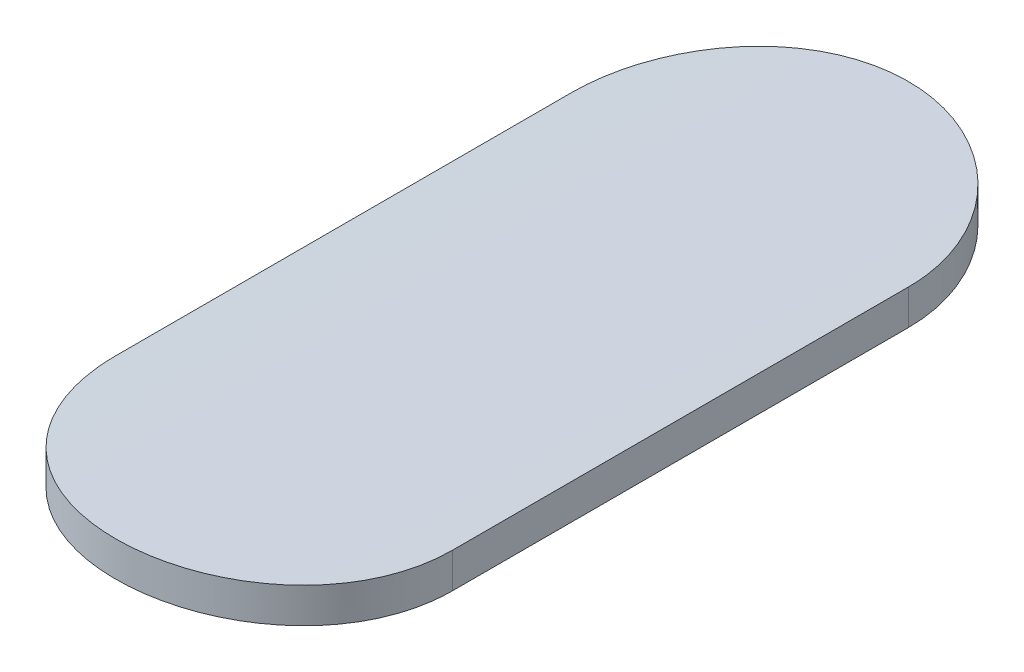
ISO-10303-21;
HEADER;
FILE_DESCRIPTION(('STEP AP214'),'2;1');
FILE_NAME('part.step','',(''),(''),'','','');
FILE_SCHEMA(('AUTOMOTIVE_DESIGN { 1 0 10303 214 1 1 1 1 }'));
ENDSEC;
DATA;
#1=APPLICATION_CONTEXT('core data for automotive mechanical design processes');
#2=APPLICATION_PROTOCOL_DEFINITION('international standard','automotive_design',2000,#1);
#3=PRODUCT_CONTEXT('',#1,'mechanical');
#4=PRODUCT('Part','Part','',(#3));
#5=PRODUCT_RELATED_PRODUCT_CATEGORY('part','',(#4));
#6=PRODUCT_DEFINITION_FORMATION('','',#4);
#7=PRODUCT_DEFINITION_CONTEXT('part definition',#1,'design');
#8=PRODUCT_DEFINITION('design','',#6,#7);
#9=PRODUCT_DEFINITION_SHAPE('','',#8);
#10=(LENGTH_UNIT() NAMED_UNIT(*) SI_UNIT(.MILLI.,.METRE.));
#11=(NAMED_UNIT(*) PLANE_ANGLE_UNIT() SI_UNIT($,.RADIAN.));
#12=(NAMED_UNIT(*) SI_UNIT($,.STERADIAN.) SOLID_ANGLE_UNIT());
#13=UNCERTAINTY_MEASURE_WITH_UNIT(LENGTH_MEASURE(1.E-05),#10,'distance_accuracy_value','');
#14=(GEOMETRIC_REPRESENTATION_CONTEXT(3) GLOBAL_UNCERTAINTY_ASSIGNED_CONTEXT((#13)) GLOBAL_UNIT_ASSIGNED_CONTEXT((#10,
#11,#12)) REPRESENTATION_CONTEXT('',''));
#15=CARTESIAN_POINT('',(0.,0.,0.));
#16=DIRECTION('',(0.,0.,1.));
#17=DIRECTION('',(1.,0.,0.));
#18=AXIS2_PLACEMENT_3D('',#15,#16,#17);
#19=CARTESIAN_POINT('',(-205.237767720161,-97.4477839792411,1.93657000024666));
#20=DIRECTION('',(0.,0.,1.));
#21=DIRECTION('',(1.,0.,0.));
#22=AXIS2_PLACEMENT_3D('',#19,#20,#21);
#23=CYLINDRICAL_SURFACE('',#22,5.00000000000003);
#24=DIRECTION('',(0.,0.,1.));
#25=VECTOR('',#24,1.);
#26=CARTESIAN_POINT('',(-205.816025312001,-92.4813347287725,7.15573389731873));
#27=LINE('',#26,#25);
#28=CARTESIAN_POINT('',(-205.816025312001,-92.4813347287725,5.59072481894893));
#29=VERTEX_POINT('',#28);
#30=CARTESIAN_POINT('',(-205.816025312001,-92.4813347287725,7.15573389731873));
#31=VERTEX_POINT('',#30);
#32=EDGE_CURVE('E72',#29,#31,#27,.T.);
#33=ORIENTED_EDGE('',*,*,#32,.T.);
#34=CARTESIAN_POINT('',(-204.659510128705,-92.4813347287279,7.15573389731873));
#35=CARTESIAN_POINT('',(-204.65948198318,-92.4813470453749,7.18814998051294));
#36=CARTESIAN_POINT('',(-204.66223416535,-92.4810176971892,7.22055534875819));
#37=CARTESIAN_POINT('',(-204.673088717127,-92.4797671597198,7.28441363488718));
#38=CARTESIAN_POINT('',(-204.681185705116,-92.4788465657793,7.31586747756811));
#39=CARTESIAN_POINT('',(-204.702524070631,-92.4765042566045,7.37697164325596));
#40=CARTESIAN_POINT('',(-204.715767326654,-92.4750823584012,7.40662130312213));
#41=CARTESIAN_POINT('',(-204.747006549714,-92.4719020810574,7.46327409037916));
#42=CARTESIAN_POINT('',(-204.765001863621,-92.4701437481661,7.49027758076553));
#43=CARTESIAN_POINT('',(-204.805325364428,-92.4664785790867,7.54099954981867));
#44=CARTESIAN_POINT('',(-204.827671036202,-92.4645711628689,7.56470408707732));
#45=CARTESIAN_POINT('',(-204.876032349208,-92.4608275253215,7.60804336459652));
#46=CARTESIAN_POINT('',(-204.902049364491,-92.4589913309773,7.62767657428107));
#47=CARTESIAN_POINT('',(-204.957107529511,-92.4555908299197,7.66236409441225));
#48=CARTESIAN_POINT('',(-204.986158174165,-92.4540274204009,7.6774034128256));
#49=CARTESIAN_POINT('',(-205.046371666948,-92.4513580548523,7.70236837040188));
#50=CARTESIAN_POINT('',(-205.077531998354,-92.4502515645608,7.71229998520296));
#51=CARTESIAN_POINT('',(-205.13034615267,-92.4488934431359,7.72433731075687));
#52=CARTESIAN_POINT('',(-205.151664012772,-92.4484793797971,7.72795250716273));
#53=CARTESIAN_POINT('',(-205.194574057236,-92.4479245041211,7.73278007816717));
#54=CARTESIAN_POINT('',(-205.216166245618,-92.4477836957932,7.7339924175097));
#55=CARTESIAN_POINT('',(-205.270132833281,-92.4477844039261,7.73399009774737));
#56=CARTESIAN_POINT('',(-205.302518792684,-92.448101558574,7.73126510134118));
#57=CARTESIAN_POINT('',(-205.36639046982,-92.449336246177,7.72043685244453));
#58=CARTESIAN_POINT('',(-205.397875198236,-92.4502544143552,7.71232790942487));
#59=CARTESIAN_POINT('',(-205.459010687186,-92.4525875978119,7.69097284333573));
#60=CARTESIAN_POINT('',(-205.488662624789,-92.4540022902267,7.67773005795219));
#61=CARTESIAN_POINT('',(-205.545317635545,-92.4571708752444,7.64648980535051));
#62=CARTESIAN_POINT('',(-205.572321144898,-92.4589247118479,7.62849312291701));
#63=CARTESIAN_POINT('',(-205.623045523049,-92.4625847434808,7.58816547581898));
#64=CARTESIAN_POINT('',(-205.646752120136,-92.4644915478026,7.56581661476484));
#65=CARTESIAN_POINT('',(-205.690087991771,-92.4682377457699,7.51745532118681));
#66=CARTESIAN_POINT('',(-205.709716908808,-92.4700771334931,7.49144256776674));
#67=CARTESIAN_POINT('',(-205.744395340358,-92.4734866329095,7.43639752630433));
#68=CARTESIAN_POINT('',(-205.759430426865,-92.4750558895899,7.40735610141008));
#69=CARTESIAN_POINT('',(-205.784398136002,-92.4777383200303,7.34714349325488));
#70=CARTESIAN_POINT('',(-205.794333600315,-92.4788517477236,7.31597350709653));
#71=CARTESIAN_POINT('',(-205.806375173798,-92.4802182866102,7.26313576380741));
#72=CARTESIAN_POINT('',(-205.809991257807,-92.4806348583557,7.24180410654379));
#73=CARTESIAN_POINT('',(-205.81481628588,-92.4811939415349,7.19889604255407));
#74=CARTESIAN_POINT('',(-205.816028473882,-92.4813368222921,7.17732000522883));
#75=CARTESIAN_POINT('',(-205.816025312001,-92.4813347287726,7.15573389731873));
#76=B_SPLINE_CURVE_WITH_KNOTS('',3,(#34,#35,#36,#37,#38,#39,#40,#41,#42,#43,#44,#45,#46,#47,#48,
#49,#50,#51,#52,#53,#54,#55,#56,#57,#58,#59,#60,#61,#62,#63,#64,#65,#66,#67,#68,#69,#70,#71,#72,
#73,#74,#75),.UNSPECIFIED.,.F.,.F.,(4,2,2,2,2,2,2,2,2,2,2,2,2,2,2,2,2,2,2,2,4),(0.,
0.0971141698560033,0.194130705514868,0.291182687565262,0.38822133755357,0.485658369900074,
0.583131966607677,0.680920348294419,0.778594063001622,0.843344867671607,0.908096622394174,
1.00511304740935,1.10223217692016,1.19928827157682,1.29632835398478,1.3937762336066,
1.49123265335904,1.58899208404561,1.68669698057032,1.75148885975864,1.81619324588166),.UNSPECIFIED.);
#77=CARTESIAN_POINT('',(-204.659510128705,-92.4813347287279,7.15573389731873));
#78=VERTEX_POINT('',#77);
#79=EDGE_CURVE('E21',#78,#31,#76,.T.);
#80=ORIENTED_EDGE('',*,*,#79,.F.);
#81=DIRECTION('',(0.,0.,1.));
#82=VECTOR('',#81,1.);
#83=CARTESIAN_POINT('',(-204.659510128705,-92.4813347287279,5.59072481894893));
#84=LINE('',#83,#82);
#85=CARTESIAN_POINT('',(-204.659510128705,-92.4813347287279,5.59072481894893));
#86=VERTEX_POINT('',#85);
#87=EDGE_CURVE('E59',#78,#86,#84,.F.);
#88=ORIENTED_EDGE('',*,*,#87,.T.);
#89=CARTESIAN_POINT('',(-205.816025312001,-92.4813347287726,5.59072481894893));
#90=CARTESIAN_POINT('',(-205.81605345322,-92.4813470455981,5.55830863861092));
#91=CARTESIAN_POINT('',(-205.813301256707,-92.4810176953498,5.52590317346145));
#92=CARTESIAN_POINT('',(-205.802446677341,-92.4797671542148,5.46204489278407));
#93=CARTESIAN_POINT('',(-205.794349708049,-92.4788465622047,5.43059114696672));
#94=CARTESIAN_POINT('',(-205.773011592033,-92.4765042816047,5.36948772147697));
#95=CARTESIAN_POINT('',(-205.759768660538,-92.4750824191753,5.33983867185812));
#96=CARTESIAN_POINT('',(-205.728529674045,-92.4719021558279,5.2831857784813));
#97=CARTESIAN_POINT('',(-205.710534070537,-92.4701437868815,5.25618168379413));
#98=CARTESIAN_POINT('',(-205.670207756246,-92.4664783744416,5.20545632084828));
#99=CARTESIAN_POINT('',(-205.647859171863,-92.4645707380577,5.18174930304969));
#100=CARTESIAN_POINT('',(-205.599497501548,-92.460827112354,5.13841097931235));
#101=CARTESIAN_POINT('',(-205.573483858366,-92.4589911339836,5.11878029427913));
#102=CARTESIAN_POINT('',(-205.518441967116,-92.4555917582716,5.08410392899674));
#103=CARTESIAN_POINT('',(-205.489405485113,-92.4540291382538,5.069071235734));
#104=CARTESIAN_POINT('',(-205.429200909222,-92.4513592357457,5.044101518923));
#105=CARTESIAN_POINT('',(-205.398033010825,-92.4502519115612,5.03416402875607));
#106=CARTESIAN_POINT('',(-205.334596648131,-92.4486214638352,5.01970858143144));
#107=CARTESIAN_POINT('',(-205.302333729771,-92.4480957495245,5.01516658343607));
#108=CARTESIAN_POINT('',(-205.237498790808,-92.4476789168199,5.01155656965433));
#109=CARTESIAN_POINT('',(-205.204926773204,-92.4477877922755,5.01248850081491));
#110=CARTESIAN_POINT('',(-205.140563410856,-92.4486257894006,5.01978072308768));
#111=CARTESIAN_POINT('',(-205.108769075323,-92.4493519393145,5.02611500604297));
#112=CARTESIAN_POINT('',(-205.046697948224,-92.4513395212461,5.04399149063637));
#113=CARTESIAN_POINT('',(-205.016421173954,-92.4526009593627,5.05553375161361));
#114=CARTESIAN_POINT('',(-204.958162773233,-92.4555225006161,5.08352681484928));
#115=CARTESIAN_POINT('',(-204.930186698027,-92.4571835321094,5.09998906940354));
#116=CARTESIAN_POINT('',(-204.87738579882,-92.4607180906581,5.1373457053417));
#117=CARTESIAN_POINT('',(-204.852560962508,-92.4625916168832,5.15824006940835));
#118=CARTESIAN_POINT('',(-204.806616299284,-92.4663540775476,5.2040107359125));
#119=CARTESIAN_POINT('',(-204.785518493568,-92.4682430387985,5.22890914671356));
#120=CARTESIAN_POINT('',(-204.747792196947,-92.4718132541877,5.28191400103789));
#121=CARTESIAN_POINT('',(-204.731165046413,-92.473494445952,5.31002140307576));
#122=CARTESIAN_POINT('',(-204.702849827051,-92.4764596597479,5.36867354385032));
#123=CARTESIAN_POINT('',(-204.691166312109,-92.4777433152941,5.39922049915787));
#124=CARTESIAN_POINT('',(-204.67312304922,-92.479759834021,5.46182387993561));
#125=CARTESIAN_POINT('',(-204.666755270332,-92.4804935279044,5.49387795079404));
#126=CARTESIAN_POINT('',(-204.660710580302,-92.4811955947182,5.5476435374774));
#127=CARTESIAN_POINT('',(-204.659499727931,-92.4813388156744,5.56918928601576));
#128=CARTESIAN_POINT('',(-204.659510128705,-92.4813347287279,5.59072481894893));
#129=B_SPLINE_CURVE_WITH_KNOTS('',3,(#89,#90,#91,#92,#93,#94,#95,#96,#97,#98,#99,#100,#101,#102,
#103,#104,#105,#106,#107,#108,#109,#110,#111,#112,#113,#114,#115,#116,#117,#118,#119,#120,#121,
#122,#123,#124,#125,#126,#127,#128),.UNSPECIFIED.,.F.,.F.,(4,2,2,2,2,2,2,2,2,2,2,2,2,2,2,2,2,2,
2,4),(0.,0.0971144596016317,0.194130705508772,0.291180629617419,0.388221337577798,
0.485669235955006,0.58313196669033,0.680867490696586,0.778594062484605,0.87588353827593,
0.973172071143981,1.0699948615776,1.16681875522746,1.26386980537719,1.36092047633352,
1.4585266740161,1.55616210298787,1.65388727516013,1.75146453691094,1.81606442695371),.UNSPECIFIED.);
#130=EDGE_CURVE('E73',#29,#86,#129,.T.);
#131=ORIENTED_EDGE('',*,*,#130,.F.);
#132=EDGE_LOOP('',(#33,#80,#88,#131));
#133=FACE_BOUND('',#132,.T.);
#134=ADVANCED_FACE('F17',(#133),#23,.T.);
#135=CARTESIAN_POINT('',(-205.816025312001,-90.5682667595488,7.15573389731873));
#136=DIRECTION('',(1.,0.,0.));
#137=DIRECTION('',(0.,1.,0.));
#138=AXIS2_PLACEMENT_3D('',#135,#136,#137);
#139=PLANE('',#138);
#140=DIRECTION('',(0.,0.,1.));
#141=VECTOR('',#140,1.);
#142=CARTESIAN_POINT('',(-205.816025312001,-92.6021655298087,1.93657000024666));
#143=LINE('',#142,#141);
#144=CARTESIAN_POINT('',(-205.816025312001,-92.6021655298087,5.59072481894893));
#145=VERTEX_POINT('',#144);
#146=CARTESIAN_POINT('',(-205.816025312001,-92.6021655298087,7.15573389731873));
#147=VERTEX_POINT('',#146);
#148=EDGE_CURVE('E80',#145,#147,#143,.T.);
#149=ORIENTED_EDGE('',*,*,#148,.T.);
#150=DIRECTION('',(0.,1.,0.));
#151=VECTOR('',#150,1.);
#152=CARTESIAN_POINT('',(-205.816025312001,-90.5682667595488,7.15573389731873));
#153=LINE('',#152,#151);
#154=EDGE_CURVE('E67',#31,#147,#153,.F.);
#155=ORIENTED_EDGE('',*,*,#154,.F.);
#156=ORIENTED_EDGE('',*,*,#32,.F.);
#157=DIRECTION('',(0.,1.,0.));
#158=VECTOR('',#157,1.);
#159=CARTESIAN_POINT('',(-205.816025312001,-90.5682667595488,5.59072481894893));
#160=LINE('',#159,#158);
#161=EDGE_CURVE('E106',#145,#29,#160,.T.);
#162=ORIENTED_EDGE('',*,*,#161,.F.);
#163=EDGE_LOOP('',(#149,#155,#156,#162));
#164=FACE_BOUND('',#163,.T.);
#165=ADVANCED_FACE('F79',(#164),#139,.F.);
#166=CARTESIAN_POINT('',(-205.237767720353,-90.5682667595488,7.15573389731873));
#167=DIRECTION('',(0.,1.,0.));
#168=DIRECTION('',(0.,0.,1.));
#169=AXIS2_PLACEMENT_3D('',#166,#167,#168);
#170=CYLINDRICAL_SURFACE('',#169,0.578257591648153);
#171=DIRECTION('',(0.,1.,0.));
#172=VECTOR('',#171,1.);
#173=CARTESIAN_POINT('',(-204.659510128705,-90.5682667595488,7.15573389731873));
#174=LINE('',#173,#172);
#175=CARTESIAN_POINT('',(-204.659510128705,-92.6021655297629,7.15573389731873));
#176=VERTEX_POINT('',#175);
#177=EDGE_CURVE('E69',#176,#78,#174,.T.);
#178=ORIENTED_EDGE('',*,*,#177,.T.);
#179=ORIENTED_EDGE('',*,*,#79,.T.);
#180=ORIENTED_EDGE('',*,*,#154,.T.);
#181=CARTESIAN_POINT('',(-205.816025312001,-92.6021655298087,7.15573389731873));
#182=CARTESIAN_POINT('',(-205.816053483011,-92.6021781533448,7.18814425723485));
#183=CARTESIAN_POINT('',(-205.813302242279,-92.6018407072796,7.22054377871234));
#184=CARTESIAN_POINT('',(-205.802451748411,-92.6005594713111,7.28438989575978));
#185=CARTESIAN_POINT('',(-205.79435794951,-92.5996162998216,7.31583742900935));
#186=CARTESIAN_POINT('',(-205.773028532762,-92.5972166227453,7.37692903347828));
#187=CARTESIAN_POINT('',(-205.759791067541,-92.5957599327431,7.40657245231106));
#188=CARTESIAN_POINT('',(-205.72856598305,-92.592501890348,7.46321402902392));
#189=CARTESIAN_POINT('',(-205.710578992223,-92.5907005835624,7.49021253622344));
#190=CARTESIAN_POINT('',(-205.670270074694,-92.5869454143927,7.54093201118305));
#191=CARTESIAN_POINT('',(-205.647929782689,-92.5849909274355,7.56463833790324));
#192=CARTESIAN_POINT('',(-205.599578955999,-92.5811547858218,7.60798251886091));
#193=CARTESIAN_POINT('',(-205.573567048307,-92.5792731587483,7.62761884430279));
#194=CARTESIAN_POINT('',(-205.518514038446,-92.5757880639238,7.66231655332473));
#195=CARTESIAN_POINT('',(-205.489463015216,-92.5741855557636,7.67736228299794));
#196=CARTESIAN_POINT('',(-205.429246573441,-92.5714492396962,7.70233959081214));
#197=CARTESIAN_POINT('',(-205.398083675089,-92.5703148842015,7.71227714722905));
#198=CARTESIAN_POINT('',(-205.345254120649,-92.568922106144,7.72432554950754));
#199=CARTESIAN_POINT('',(-205.323923699689,-92.5684973477259,7.72794513583304));
#200=CARTESIAN_POINT('',(-205.280987857234,-92.5679281371332,7.73277858754593));
#201=CARTESIAN_POINT('',(-205.259382431801,-92.5677836889786,7.73399241843244));
#202=CARTESIAN_POINT('',(-205.205408498434,-92.5677844137908,7.73399009747099));
#203=CARTESIAN_POINT('',(-205.173028463901,-92.5681092485121,7.73126608074176));
#204=CARTESIAN_POINT('',(-205.109168744159,-92.5693738397721,7.7204419080819));
#205=CARTESIAN_POINT('',(-205.077690046997,-92.5703142460471,7.71233607150626));
#206=CARTESIAN_POINT('',(-205.016566704827,-92.572703965736,7.69098974116801));
#207=CARTESIAN_POINT('',(-204.986920864252,-92.5741529432019,7.67775263637735));
#208=CARTESIAN_POINT('',(-204.930276903842,-92.5773984387611,7.64652630180868));
#209=CARTESIAN_POINT('',(-204.903278353576,-92.5791949002142,7.62853784632979));
#210=CARTESIAN_POINT('',(-204.852556592957,-92.5829445142571,7.58822470032501));
#211=CARTESIAN_POINT('',(-204.828848336295,-92.5848983222903,7.5658812554279));
#212=CARTESIAN_POINT('',(-204.785507790757,-92.5887372053062,7.51753055202186));
#213=CARTESIAN_POINT('',(-204.765875861897,-92.5906222742059,7.49152297024134));
#214=CARTESIAN_POINT('',(-204.731187341408,-92.5941170846154,7.4364831145905));
#215=CARTESIAN_POINT('',(-204.716145861998,-92.5957259092593,7.40744126391924));
#216=CARTESIAN_POINT('',(-204.691165865014,-92.5984762631509,7.34722566000814));
#217=CARTESIAN_POINT('',(-204.681224494261,-92.5996180536012,7.31605310984247));
#218=CARTESIAN_POINT('',(-204.669171948261,-92.6010198762337,7.26320013809462));
#219=CARTESIAN_POINT('',(-204.665551522192,-92.601447339911,7.24185609777539));
#220=CARTESIAN_POINT('',(-204.660720634795,-92.6020210553048,7.19892245746074));
#221=CARTESIAN_POINT('',(-204.659506943357,-92.6021676839245,7.17733322575626));
#222=CARTESIAN_POINT('',(-204.659510128705,-92.6021655297629,7.15573389731874));
#223=B_SPLINE_CURVE_WITH_KNOTS('',3,(#181,#182,#183,#184,#185,#186,#187,#188,#189,#190,#191,
#192,#193,#194,#195,#196,#197,#198,#199,#200,#201,#202,#203,#204,#205,#206,#207,#208,#209,#210,
#211,#212,#213,#214,#215,#216,#217,#218,#219,#220,#221,#222),.UNSPECIFIED.,.F.,.F.,(4,2,2,2,2,2,
2,2,2,2,2,2,2,2,2,2,2,2,2,2,4),(0.,0.0970967769414798,0.194094580460969,0.291127253506241,
0.388147093901721,0.485585457891435,0.583060356133905,0.68086402111786,0.77855296090041,
0.843343411859865,0.908134791971191,1.00513347976346,1.10223471520449,1.19927192861068,
1.29629333819037,1.39374218059266,1.49119962589251,1.58897453338934,1.68669468236564,
1.75152566852515,1.81626958514255),.UNSPECIFIED.);
#224=EDGE_CURVE('E91',#147,#176,#223,.T.);
#225=ORIENTED_EDGE('',*,*,#224,.T.);
#226=EDGE_LOOP('',(#178,#179,#180,#225));
#227=FACE_BOUND('',#226,.T.);
#228=ADVANCED_FACE('F65',(#227),#170,.T.);
#229=CARTESIAN_POINT('',(-204.659510128705,-90.5682667595488,5.59072481894893));
#230=DIRECTION('',(-1.,0.,0.));
#231=DIRECTION('',(0.,0.,1.));
#232=AXIS2_PLACEMENT_3D('',#229,#230,#231);
#233=PLANE('',#232);
#234=DIRECTION('',(0.,0.,1.));
#235=VECTOR('',#234,1.);
#236=CARTESIAN_POINT('',(-204.659510128705,-92.6021655297629,1.93657000024666));
#237=LINE('',#236,#235);
#238=CARTESIAN_POINT('',(-204.659510128705,-92.6021655297629,5.59072481894893));
#239=VERTEX_POINT('',#238);
#240=EDGE_CURVE('E31',#176,#239,#237,.F.);
#241=ORIENTED_EDGE('',*,*,#240,.T.);
#242=DIRECTION('',(0.,1.,0.));
#243=VECTOR('',#242,1.);
#244=CARTESIAN_POINT('',(-204.659510128705,-90.5682667595488,5.59072481894893));
#245=LINE('',#244,#243);
#246=EDGE_CURVE('E39',#86,#239,#245,.F.);
#247=ORIENTED_EDGE('',*,*,#246,.F.);
#248=ORIENTED_EDGE('',*,*,#87,.F.);
#249=ORIENTED_EDGE('',*,*,#177,.F.);
#250=EDGE_LOOP('',(#241,#247,#248,#249));
#251=FACE_BOUND('',#250,.T.);
#252=ADVANCED_FACE('F101',(#251),#233,.F.);
#253=CARTESIAN_POINT('',(-205.237767720353,-90.5682667595488,5.59072481894893));
#254=DIRECTION('',(0.,1.,0.));
#255=DIRECTION('',(0.,0.,1.));
#256=AXIS2_PLACEMENT_3D('',#253,#254,#255);
#257=CYLINDRICAL_SURFACE('',#256,0.57825759164816);
#258=ORIENTED_EDGE('',*,*,#246,.T.);
#259=CARTESIAN_POINT('',(-204.659510128705,-92.6021655297629,5.59072481894893));
#260=CARTESIAN_POINT('',(-204.659481961999,-92.6021781534809,5.55831436294543));
#261=CARTESIAN_POINT('',(-204.662233216893,-92.6018407053248,5.52591474561659));
#262=CARTESIAN_POINT('',(-204.673083737999,-92.6005594656419,5.46206863396068));
#263=CARTESIAN_POINT('',(-204.681177518388,-92.5996162961099,5.43062119652029));
#264=CARTESIAN_POINT('',(-204.702506686611,-92.5972166482127,5.36953032958924));
#265=CARTESIAN_POINT('',(-204.715743828236,-92.5957599947747,5.33988751943547));
#266=CARTESIAN_POINT('',(-204.746968676782,-92.5925019666882,5.2832458369072));
#267=CARTESIAN_POINT('',(-204.764955956315,-92.5907006230567,5.25624672696866));
#268=CARTESIAN_POINT('',(-204.805267682024,-92.5869452049457,5.20552386359215));
#269=CARTESIAN_POINT('',(-204.827610881779,-92.5849904927257,5.1818150597932));
#270=CARTESIAN_POINT('',(-204.875962064954,-92.5811543632185,5.13847183093529));
#271=CARTESIAN_POINT('',(-204.901970605743,-92.5792729571343,5.11883802666281));
#272=CARTESIAN_POINT('',(-204.957007359644,-92.5757890145145,5.08415146508722));
#273=CARTESIAN_POINT('',(-204.986044233256,-92.5741873148731,5.06911235800726));
#274=CARTESIAN_POINT('',(-205.046251761114,-92.5714504492918,5.04413029506569));
#275=CARTESIAN_POINT('',(-205.077422216702,-92.5703152399854,5.03418686547275));
#276=CARTESIAN_POINT('',(-205.140858450405,-92.5686436759724,5.01972236334703));
#277=CARTESIAN_POINT('',(-205.173118400204,-92.5681045352239,5.01517605707734));
#278=CARTESIAN_POINT('',(-205.237948363892,-92.5676763461855,5.0115566635926));
#279=CARTESIAN_POINT('',(-205.270518374271,-92.5677872905474,5.01248351451155));
#280=CARTESIAN_POINT('',(-205.334870590047,-92.5686445338117,5.01976402737541));
#281=CARTESIAN_POINT('',(-205.366655931583,-92.5693876374871,5.02609039816412));
#282=CARTESIAN_POINT('',(-205.428710384106,-92.571422086611,5.04394771351856));
#283=CARTESIAN_POINT('',(-205.458979476824,-92.5727134386636,5.05547872077931));
#284=CARTESIAN_POINT('',(-205.517227863834,-92.5757048001304,5.08344752444821));
#285=CARTESIAN_POINT('',(-205.545201352274,-92.5774058053395,5.09989730143445));
#286=CARTESIAN_POINT('',(-205.597999733442,-92.5810258910445,5.13722720407114));
#287=CARTESIAN_POINT('',(-205.622824631438,-92.5829449711756,5.1581073223104));
#288=CARTESIAN_POINT('',(-205.668779656381,-92.5868000571643,5.20385525414045));
#289=CARTESIAN_POINT('',(-205.689886659469,-92.5887360953951,5.228746299807));
#290=CARTESIAN_POINT('',(-205.727632669796,-92.5923958859476,5.28173856788992));
#291=CARTESIAN_POINT('',(-205.74427034065,-92.5941195746911,5.30984074690242));
#292=CARTESIAN_POINT('',(-205.772607859074,-92.5971604007767,5.36848601375705));
#293=CARTESIAN_POINT('',(-205.784303026303,-92.5984771524508,5.39903138279795));
#294=CARTESIAN_POINT('',(-205.802369312691,-92.6005463291697,5.4616345708446));
#295=CARTESIAN_POINT('',(-205.808748459045,-92.6012996048868,5.49369003198986));
#296=CARTESIAN_POINT('',(-205.814817911293,-92.6020220986538,5.54751915967322));
#297=CARTESIAN_POINT('',(-205.816035806626,-92.6021697551819,5.56912707876276));
#298=CARTESIAN_POINT('',(-205.816025312001,-92.6021655298087,5.59072481894893));
#299=B_SPLINE_CURVE_WITH_KNOTS('',3,(#259,#260,#261,#262,#263,#264,#265,#266,#267,#268,#269,
#270,#271,#272,#273,#274,#275,#276,#277,#278,#279,#280,#281,#282,#283,#284,#285,#286,#287,#288,
#289,#290,#291,#292,#293,#294,#295,#296,#297,#298),.UNSPECIFIED.,.F.,.F.,(4,2,2,2,2,2,2,2,2,2,2,
2,2,2,2,2,2,2,2,4),(0.,0.0970970635383435,0.194094580457033,0.291125200809994,0.388147093931789,
0.485596307798213,0.583060356224489,0.680811202926225,0.778552960347213,0.875835912772297,
0.973117765558745,1.06991081233848,1.1667050251181,1.26373694568975,1.36076870394509,
1.45838414810372,1.55602874807589,1.65376560730432,1.75135461501377,1.81614074530074),.UNSPECIFIED.);
#300=EDGE_CURVE('E11',#239,#145,#299,.T.);
#301=ORIENTED_EDGE('',*,*,#300,.T.);
#302=ORIENTED_EDGE('',*,*,#161,.T.);
#303=ORIENTED_EDGE('',*,*,#130,.T.);
#304=EDGE_LOOP('',(#258,#301,#302,#303));
#305=FACE_BOUND('',#304,.T.);
#306=ADVANCED_FACE('F97',(#305),#257,.T.);
#307=CARTESIAN_POINT('',(-205.237767720161,-97.4477839792411,1.93657000024666));
#308=DIRECTION('',(0.,0.,1.));
#309=DIRECTION('',(1.,0.,0.));
#310=AXIS2_PLACEMENT_3D('',#307,#308,#309);
#311=CYLINDRICAL_SURFACE('',#310,4.88000000000002);
#312=ORIENTED_EDGE('',*,*,#240,.F.);
#313=ORIENTED_EDGE('',*,*,#224,.F.);
#314=ORIENTED_EDGE('',*,*,#148,.F.);
#315=ORIENTED_EDGE('',*,*,#300,.F.);
#316=EDGE_LOOP('',(#312,#313,#314,#315));
#317=FACE_BOUND('',#316,.T.);
#318=ADVANCED_FACE('F95',(#317),#311,.F.);
#319=CLOSED_SHELL('',(#134,#165,#228,#252,#306,#318));
#320=MANIFOLD_SOLID_BREP('B1',#319);
#321=ADVANCED_BREP_SHAPE_REPRESENTATION('',(#18,#320),#14);
#322=SHAPE_DEFINITION_REPRESENTATION(#9,#321);
ENDSEC;
END-ISO-10303-21;
